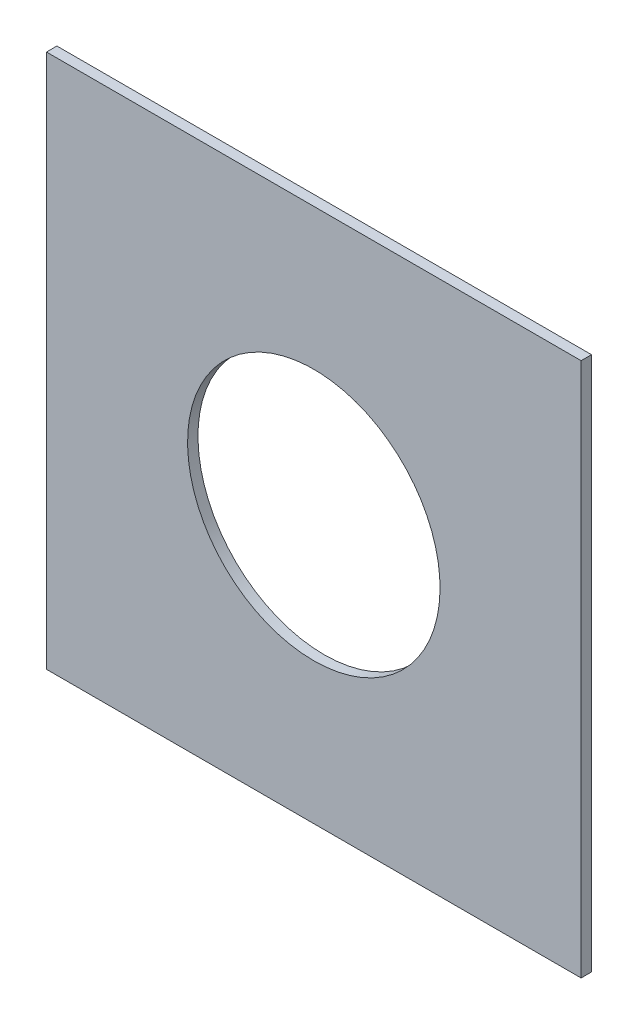
ISO-10303-21;
HEADER;
FILE_DESCRIPTION(('STEP AP214'),'2;1');
FILE_NAME('part.step','',(''),(''),'','','');
FILE_SCHEMA(('AUTOMOTIVE_DESIGN { 1 0 10303 214 1 1 1 1 }'));
ENDSEC;
DATA;
#1=APPLICATION_CONTEXT('core data for automotive mechanical design processes');
#2=APPLICATION_PROTOCOL_DEFINITION('international standard','automotive_design',2000,#1);
#3=PRODUCT_CONTEXT('',#1,'mechanical');
#4=PRODUCT('Part','Part','',(#3));
#5=PRODUCT_RELATED_PRODUCT_CATEGORY('part','',(#4));
#6=PRODUCT_DEFINITION_FORMATION('','',#4);
#7=PRODUCT_DEFINITION_CONTEXT('part definition',#1,'design');
#8=PRODUCT_DEFINITION('design','',#6,#7);
#9=PRODUCT_DEFINITION_SHAPE('','',#8);
#10=(LENGTH_UNIT() NAMED_UNIT(*) SI_UNIT(.MILLI.,.METRE.));
#11=(NAMED_UNIT(*) PLANE_ANGLE_UNIT() SI_UNIT($,.RADIAN.));
#12=(NAMED_UNIT(*) SI_UNIT($,.STERADIAN.) SOLID_ANGLE_UNIT());
#13=UNCERTAINTY_MEASURE_WITH_UNIT(LENGTH_MEASURE(1.E-05),#10,'distance_accuracy_value','');
#14=(GEOMETRIC_REPRESENTATION_CONTEXT(3) GLOBAL_UNCERTAINTY_ASSIGNED_CONTEXT((#13)) GLOBAL_UNIT_ASSIGNED_CONTEXT((#10,
#11,#12)) REPRESENTATION_CONTEXT('',''));
#15=CARTESIAN_POINT('',(0.,0.,0.));
#16=DIRECTION('',(0.,0.,1.));
#17=DIRECTION('',(1.,0.,0.));
#18=AXIS2_PLACEMENT_3D('',#15,#16,#17);
#19=CARTESIAN_POINT('',(169.418,-153.249,-0.045));
#20=DIRECTION('',(0.,0.,-1.));
#21=DIRECTION('',(0.,-1.,0.));
#22=AXIS2_PLACEMENT_3D('',#19,#20,#21);
#23=CYLINDRICAL_SURFACE('',#22,0.425);
#24=CARTESIAN_POINT('',(169.418,-153.249,-0.035));
#25=DIRECTION('',(0.,0.,-1.));
#26=DIRECTION('',(0.,-1.,0.));
#27=AXIS2_PLACEMENT_3D('',#24,#25,#26);
#28=CIRCLE('',#27,0.425);
#29=CARTESIAN_POINT('',(169.418,-153.674,-0.035));
#30=VERTEX_POINT('',#29);
#31=EDGE_CURVE('E20',#30,#30,#28,.T.);
#32=ORIENTED_EDGE('',*,*,#31,.T.);
#33=DIRECTION('',(0.,0.,1.));
#34=VECTOR('',#33,1.);
#35=CARTESIAN_POINT('',(169.418,-153.674,-0.045));
#36=LINE('',#35,#34);
#37=CARTESIAN_POINT('',(169.418,-153.674,0.));
#38=VERTEX_POINT('',#37);
#39=EDGE_CURVE('E11',#30,#38,#36,.T.);
#40=ORIENTED_EDGE('',*,*,#39,.T.);
#41=CARTESIAN_POINT('',(169.418,-153.249,0.));
#42=DIRECTION('',(0.,0.,-1.));
#43=DIRECTION('',(0.,-1.,0.));
#44=AXIS2_PLACEMENT_3D('',#41,#42,#43);
#45=CIRCLE('',#44,0.425);
#46=EDGE_CURVE('E27',#38,#38,#45,.T.);
#47=ORIENTED_EDGE('',*,*,#46,.F.);
#48=ORIENTED_EDGE('',*,*,#39,.F.);
#49=EDGE_LOOP('',(#32,#40,#47,#48));
#50=FACE_BOUND('',#49,.T.);
#51=ADVANCED_FACE('F17',(#50),#23,.F.);
#52=CARTESIAN_POINT('',(168.518,-152.349,-0.035));
#53=DIRECTION('',(0.,1.,0.));
#54=DIRECTION('',(1.,0.,0.));
#55=AXIS2_PLACEMENT_3D('',#52,#53,#54);
#56=PLANE('',#55);
#57=DIRECTION('',(0.,0.,1.));
#58=VECTOR('',#57,1.);
#59=CARTESIAN_POINT('',(168.518,-152.349,-0.035));
#60=LINE('',#59,#58);
#61=CARTESIAN_POINT('',(168.518,-152.349,-0.035));
#62=VERTEX_POINT('',#61);
#63=CARTESIAN_POINT('',(168.518,-152.349,0.));
#64=VERTEX_POINT('',#63);
#65=EDGE_CURVE('E95',#62,#64,#60,.T.);
#66=ORIENTED_EDGE('',*,*,#65,.T.);
#67=DIRECTION('',(1.,0.,0.));
#68=VECTOR('',#67,1.);
#69=CARTESIAN_POINT('',(168.518,-152.349,0.));
#70=LINE('',#69,#68);
#71=CARTESIAN_POINT('',(170.318,-152.349,0.));
#72=VERTEX_POINT('',#71);
#73=EDGE_CURVE('E70',#64,#72,#70,.T.);
#74=ORIENTED_EDGE('',*,*,#73,.T.);
#75=DIRECTION('',(0.,0.,1.));
#76=VECTOR('',#75,1.);
#77=CARTESIAN_POINT('',(170.318,-152.349,-0.035));
#78=LINE('',#77,#76);
#79=CARTESIAN_POINT('',(170.318,-152.349,-0.035));
#80=VERTEX_POINT('',#79);
#81=EDGE_CURVE('E108',#80,#72,#78,.T.);
#82=ORIENTED_EDGE('',*,*,#81,.F.);
#83=DIRECTION('',(1.,0.,0.));
#84=VECTOR('',#83,1.);
#85=CARTESIAN_POINT('',(168.518,-152.349,-0.035));
#86=LINE('',#85,#84);
#87=EDGE_CURVE('E59',#62,#80,#86,.T.);
#88=ORIENTED_EDGE('',*,*,#87,.F.);
#89=EDGE_LOOP('',(#66,#74,#82,#88));
#90=FACE_BOUND('',#89,.T.);
#91=ADVANCED_FACE('F154',(#90),#56,.T.);
#92=CARTESIAN_POINT('',(0.,0.,0.));
#93=DIRECTION('',(0.,0.,1.));
#94=DIRECTION('',(1.,0.,0.));
#95=AXIS2_PLACEMENT_3D('',#92,#93,#94);
#96=PLANE('',#95);
#97=ORIENTED_EDGE('',*,*,#46,.T.);
#98=EDGE_LOOP('',(#97));
#99=FACE_BOUND('',#98,.T.);
#100=DIRECTION('',(-1.,0.,0.));
#101=VECTOR('',#100,1.);
#102=CARTESIAN_POINT('',(170.318,-154.149,0.));
#103=LINE('',#102,#101);
#104=CARTESIAN_POINT('',(170.318,-154.149,0.));
#105=VERTEX_POINT('',#104);
#106=CARTESIAN_POINT('',(168.518,-154.149,0.));
#107=VERTEX_POINT('',#106);
#108=EDGE_CURVE('E111',#105,#107,#103,.T.);
#109=ORIENTED_EDGE('',*,*,#108,.F.);
#110=DIRECTION('',(0.,-1.,0.));
#111=VECTOR('',#110,1.);
#112=CARTESIAN_POINT('',(170.318,-152.349,0.));
#113=LINE('',#112,#111);
#114=EDGE_CURVE('E126',#72,#105,#113,.T.);
#115=ORIENTED_EDGE('',*,*,#114,.F.);
#116=ORIENTED_EDGE('',*,*,#73,.F.);
#117=DIRECTION('',(0.,1.,0.));
#118=VECTOR('',#117,1.);
#119=CARTESIAN_POINT('',(168.518,-154.149,0.));
#120=LINE('',#119,#118);
#121=EDGE_CURVE('E83',#107,#64,#120,.T.);
#122=ORIENTED_EDGE('',*,*,#121,.F.);
#123=EDGE_LOOP('',(#109,#115,#116,#122));
#124=FACE_BOUND('',#123,.T.);
#125=ADVANCED_FACE('F144',(#99,#124),#96,.T.);
#126=CARTESIAN_POINT('',(0.,0.,-0.035));
#127=DIRECTION('',(0.,0.,1.));
#128=DIRECTION('',(1.,0.,0.));
#129=AXIS2_PLACEMENT_3D('',#126,#127,#128);
#130=PLANE('',#129);
#131=ORIENTED_EDGE('',*,*,#31,.F.);
#132=EDGE_LOOP('',(#131));
#133=FACE_BOUND('',#132,.T.);
#134=DIRECTION('',(0.,1.,0.));
#135=VECTOR('',#134,1.);
#136=CARTESIAN_POINT('',(168.518,-154.149,-0.035));
#137=LINE('',#136,#135);
#138=CARTESIAN_POINT('',(168.518,-154.149,-0.035));
#139=VERTEX_POINT('',#138);
#140=EDGE_CURVE('E89',#139,#62,#137,.T.);
#141=ORIENTED_EDGE('',*,*,#140,.T.);
#142=ORIENTED_EDGE('',*,*,#87,.T.);
#143=DIRECTION('',(0.,-1.,0.));
#144=VECTOR('',#143,1.);
#145=CARTESIAN_POINT('',(170.318,-152.349,-0.035));
#146=LINE('',#145,#144);
#147=CARTESIAN_POINT('',(170.318,-154.149,-0.035));
#148=VERTEX_POINT('',#147);
#149=EDGE_CURVE('E103',#80,#148,#146,.T.);
#150=ORIENTED_EDGE('',*,*,#149,.T.);
#151=DIRECTION('',(-1.,0.,0.));
#152=VECTOR('',#151,1.);
#153=CARTESIAN_POINT('',(170.318,-154.149,-0.035));
#154=LINE('',#153,#152);
#155=EDGE_CURVE('E100',#148,#139,#154,.T.);
#156=ORIENTED_EDGE('',*,*,#155,.T.);
#157=EDGE_LOOP('',(#141,#142,#150,#156));
#158=FACE_BOUND('',#157,.T.);
#159=ADVANCED_FACE('F101',(#133,#158),#130,.F.);
#160=CARTESIAN_POINT('',(168.518,-154.149,-0.035));
#161=DIRECTION('',(-1.,0.,0.));
#162=DIRECTION('',(0.,0.,1.));
#163=AXIS2_PLACEMENT_3D('',#160,#161,#162);
#164=PLANE('',#163);
#165=DIRECTION('',(0.,0.,1.));
#166=VECTOR('',#165,1.);
#167=CARTESIAN_POINT('',(168.518,-154.149,-0.035));
#168=LINE('',#167,#166);
#169=EDGE_CURVE('E93',#139,#107,#168,.T.);
#170=ORIENTED_EDGE('',*,*,#169,.T.);
#171=ORIENTED_EDGE('',*,*,#121,.T.);
#172=ORIENTED_EDGE('',*,*,#65,.F.);
#173=ORIENTED_EDGE('',*,*,#140,.F.);
#174=EDGE_LOOP('',(#170,#171,#172,#173));
#175=FACE_BOUND('',#174,.T.);
#176=ADVANCED_FACE('F91',(#175),#164,.T.);
#177=CARTESIAN_POINT('',(170.318,-152.349,-0.035));
#178=DIRECTION('',(1.,0.,0.));
#179=DIRECTION('',(0.,1.,0.));
#180=AXIS2_PLACEMENT_3D('',#177,#178,#179);
#181=PLANE('',#180);
#182=ORIENTED_EDGE('',*,*,#81,.T.);
#183=ORIENTED_EDGE('',*,*,#114,.T.);
#184=DIRECTION('',(0.,0.,1.));
#185=VECTOR('',#184,1.);
#186=CARTESIAN_POINT('',(170.318,-154.149,-0.035));
#187=LINE('',#186,#185);
#188=EDGE_CURVE('E118',#148,#105,#187,.T.);
#189=ORIENTED_EDGE('',*,*,#188,.F.);
#190=ORIENTED_EDGE('',*,*,#149,.F.);
#191=EDGE_LOOP('',(#182,#183,#189,#190));
#192=FACE_BOUND('',#191,.T.);
#193=ADVANCED_FACE('F152',(#192),#181,.T.);
#194=CARTESIAN_POINT('',(170.318,-154.149,-0.035));
#195=DIRECTION('',(0.,-1.,0.));
#196=DIRECTION('',(0.,0.,-1.));
#197=AXIS2_PLACEMENT_3D('',#194,#195,#196);
#198=PLANE('',#197);
#199=ORIENTED_EDGE('',*,*,#188,.T.);
#200=ORIENTED_EDGE('',*,*,#108,.T.);
#201=ORIENTED_EDGE('',*,*,#169,.F.);
#202=ORIENTED_EDGE('',*,*,#155,.F.);
#203=EDGE_LOOP('',(#199,#200,#201,#202));
#204=FACE_BOUND('',#203,.T.);
#205=ADVANCED_FACE('F110',(#204),#198,.T.);
#206=CLOSED_SHELL('',(#51,#91,#125,#159,#176,#193,#205));
#207=MANIFOLD_SOLID_BREP('B1',#206);
#208=ADVANCED_BREP_SHAPE_REPRESENTATION('',(#18,#207),#14);
#209=SHAPE_DEFINITION_REPRESENTATION(#9,#208);
ENDSEC;
END-ISO-10303-21;
